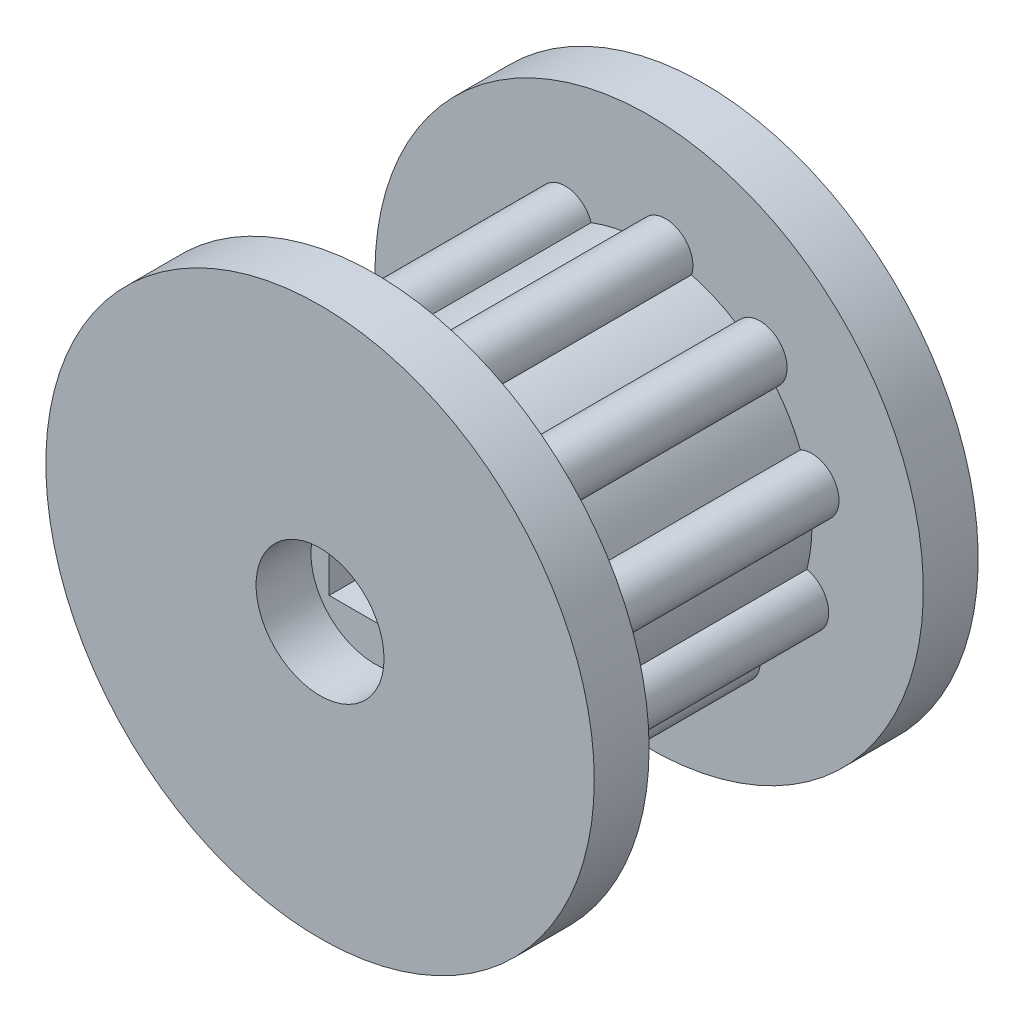
ISO-10303-21;
HEADER;
FILE_DESCRIPTION(('STEP AP214'),'2;1');
FILE_NAME('part.step','',(''),(''),'','','');
FILE_SCHEMA(('AUTOMOTIVE_DESIGN { 1 0 10303 214 1 1 1 1 }'));
ENDSEC;
DATA;
#1=APPLICATION_CONTEXT('core data for automotive mechanical design processes');
#2=APPLICATION_PROTOCOL_DEFINITION('international standard','automotive_design',2000,#1);
#3=PRODUCT_CONTEXT('',#1,'mechanical');
#4=PRODUCT('Part','Part','',(#3));
#5=PRODUCT_RELATED_PRODUCT_CATEGORY('part','',(#4));
#6=PRODUCT_DEFINITION_FORMATION('','',#4);
#7=PRODUCT_DEFINITION_CONTEXT('part definition',#1,'design');
#8=PRODUCT_DEFINITION('design','',#6,#7);
#9=PRODUCT_DEFINITION_SHAPE('','',#8);
#10=(LENGTH_UNIT() NAMED_UNIT(*) SI_UNIT(.MILLI.,.METRE.));
#11=(NAMED_UNIT(*) PLANE_ANGLE_UNIT() SI_UNIT($,.RADIAN.));
#12=(NAMED_UNIT(*) SI_UNIT($,.STERADIAN.) SOLID_ANGLE_UNIT());
#13=UNCERTAINTY_MEASURE_WITH_UNIT(LENGTH_MEASURE(1.E-05),#10,'distance_accuracy_value','');
#14=(GEOMETRIC_REPRESENTATION_CONTEXT(3) GLOBAL_UNCERTAINTY_ASSIGNED_CONTEXT((#13)) GLOBAL_UNIT_ASSIGNED_CONTEXT((#10,
#11,#12)) REPRESENTATION_CONTEXT('',''));
#15=CARTESIAN_POINT('',(0.,0.,0.));
#16=DIRECTION('',(0.,0.,1.));
#17=DIRECTION('',(1.,0.,0.));
#18=AXIS2_PLACEMENT_3D('',#15,#16,#17);
#19=CARTESIAN_POINT('',(0.45423492338537,4.53021201384048,20.));
#20=DIRECTION('',(0.,0.,1.));
#21=DIRECTION('',(1.,0.,0.));
#22=AXIS2_PLACEMENT_3D('',#19,#20,#21);
#23=PLANE('',#22);
#24=DIRECTION('',(-1.,0.,0.));
#25=VECTOR('',#24,1.);
#26=CARTESIAN_POINT('',(-2.5,1.5,20.));
#27=LINE('',#26,#25);
#28=CARTESIAN_POINT('',(2.5,1.5,20.));
#29=VERTEX_POINT('',#28);
#30=CARTESIAN_POINT('',(-2.5,1.5,20.));
#31=VERTEX_POINT('',#30);
#32=EDGE_CURVE('E758',#29,#31,#27,.T.);
#33=ORIENTED_EDGE('',*,*,#32,.F.);
#34=DIRECTION('',(0.,1.,0.));
#35=VECTOR('',#34,1.);
#36=CARTESIAN_POINT('',(2.5,-1.5,20.));
#37=LINE('',#36,#35);
#38=CARTESIAN_POINT('',(2.5,-1.5,20.));
#39=VERTEX_POINT('',#38);
#40=EDGE_CURVE('E756',#39,#29,#37,.T.);
#41=ORIENTED_EDGE('',*,*,#40,.F.);
#42=DIRECTION('',(1.,0.,0.));
#43=VECTOR('',#42,1.);
#44=CARTESIAN_POINT('',(-2.5,-1.5,20.));
#45=LINE('',#44,#43);
#46=CARTESIAN_POINT('',(-2.5,-1.5,20.));
#47=VERTEX_POINT('',#46);
#48=EDGE_CURVE('E763',#47,#39,#45,.T.);
#49=ORIENTED_EDGE('',*,*,#48,.F.);
#50=DIRECTION('',(0.,-1.,0.));
#51=VECTOR('',#50,1.);
#52=CARTESIAN_POINT('',(-2.5,-1.5,20.));
#53=LINE('',#52,#51);
#54=EDGE_CURVE('E761',#31,#47,#53,.T.);
#55=ORIENTED_EDGE('',*,*,#54,.F.);
#56=EDGE_LOOP('',(#33,#41,#49,#55));
#57=FACE_BOUND('',#56,.T.);
#58=CARTESIAN_POINT('',(0.,0.,20.));
#59=DIRECTION('',(0.,0.,1.));
#60=DIRECTION('',(1.,0.,0.));
#61=AXIS2_PLACEMENT_3D('',#58,#59,#60);
#62=CIRCLE('',#61,3.5);
#63=CARTESIAN_POINT('',(3.5,0.,20.));
#64=VERTEX_POINT('',#63);
#65=EDGE_CURVE('E734',#64,#64,#62,.T.);
#66=ORIENTED_EDGE('',*,*,#65,.T.);
#67=EDGE_LOOP('',(#66));
#68=FACE_BOUND('',#67,.T.);
#69=ADVANCED_FACE('F34',(#57,#68),#23,.T.);
#70=CARTESIAN_POINT('',(0.45423492338537,4.53021201384048,5.));
#71=DIRECTION('',(0.,0.,1.));
#72=DIRECTION('',(1.,0.,0.));
#73=AXIS2_PLACEMENT_3D('',#70,#71,#72);
#74=PLANE('',#73);
#75=DIRECTION('',(0.,1.,0.));
#76=VECTOR('',#75,1.);
#77=CARTESIAN_POINT('',(2.5,-1.5,5.));
#78=LINE('',#77,#76);
#79=CARTESIAN_POINT('',(2.5,-1.5,5.));
#80=VERTEX_POINT('',#79);
#81=CARTESIAN_POINT('',(2.5,1.5,5.));
#82=VERTEX_POINT('',#81);
#83=EDGE_CURVE('E57',#80,#82,#78,.T.);
#84=ORIENTED_EDGE('',*,*,#83,.T.);
#85=DIRECTION('',(-1.,0.,0.));
#86=VECTOR('',#85,1.);
#87=CARTESIAN_POINT('',(-2.5,1.5,5.));
#88=LINE('',#87,#86);
#89=CARTESIAN_POINT('',(-2.5,1.5,5.));
#90=VERTEX_POINT('',#89);
#91=EDGE_CURVE('E767',#82,#90,#88,.T.);
#92=ORIENTED_EDGE('',*,*,#91,.T.);
#93=DIRECTION('',(0.,-1.,0.));
#94=VECTOR('',#93,1.);
#95=CARTESIAN_POINT('',(-2.5,-1.5,5.));
#96=LINE('',#95,#94);
#97=CARTESIAN_POINT('',(-2.5,-1.5,5.));
#98=VERTEX_POINT('',#97);
#99=EDGE_CURVE('E770',#90,#98,#96,.T.);
#100=ORIENTED_EDGE('',*,*,#99,.T.);
#101=DIRECTION('',(1.,0.,0.));
#102=VECTOR('',#101,1.);
#103=CARTESIAN_POINT('',(-2.5,-1.5,5.));
#104=LINE('',#103,#102);
#105=EDGE_CURVE('E759',#98,#80,#104,.T.);
#106=ORIENTED_EDGE('',*,*,#105,.T.);
#107=EDGE_LOOP('',(#84,#92,#100,#106));
#108=FACE_BOUND('',#107,.T.);
#109=CARTESIAN_POINT('',(0.,0.,5.));
#110=DIRECTION('',(0.,0.,-1.));
#111=DIRECTION('',(-1.,0.,0.));
#112=AXIS2_PLACEMENT_3D('',#109,#110,#111);
#113=CIRCLE('',#112,3.5);
#114=CARTESIAN_POINT('',(-3.5,0.,5.));
#115=VERTEX_POINT('',#114);
#116=EDGE_CURVE('E742',#115,#115,#113,.T.);
#117=ORIENTED_EDGE('',*,*,#116,.T.);
#118=EDGE_LOOP('',(#117));
#119=FACE_BOUND('',#118,.T.);
#120=ADVANCED_FACE('F443',(#108,#119),#74,.F.);
#121=CARTESIAN_POINT('',(0.,0.,20.));
#122=DIRECTION('',(0.,0.,-1.));
#123=DIRECTION('',(-1.,0.,0.));
#124=AXIS2_PLACEMENT_3D('',#121,#122,#123);
#125=CYLINDRICAL_SURFACE('',#124,8.90704584484708);
#126=CARTESIAN_POINT('',(0.,0.,5.));
#127=DIRECTION('',(0.,0.,1.));
#128=DIRECTION('',(1.,0.,0.));
#129=AXIS2_PLACEMENT_3D('',#126,#127,#128);
#130=CIRCLE('',#129,8.90704584484708);
#131=CARTESIAN_POINT('',(4.76323695441032,7.52642274911179,5.));
#132=VERTEX_POINT('',#131);
#133=CARTESIAN_POINT('',(2.32379934039809,8.59857094567306,5.));
#134=VERTEX_POINT('',#133);
#135=EDGE_CURVE('E226',#132,#134,#130,.T.);
#136=ORIENTED_EDGE('',*,*,#135,.T.);
#137=DIRECTION('',(0.,0.,-1.));
#138=VECTOR('',#137,1.);
#139=CARTESIAN_POINT('',(2.32379934039809,8.59857094567306,20.));
#140=LINE('',#139,#138);
#141=CARTESIAN_POINT('',(2.32379934039809,8.59857094567306,20.));
#142=VERTEX_POINT('',#141);
#143=EDGE_CURVE('E11',#142,#134,#140,.T.);
#144=ORIENTED_EDGE('',*,*,#143,.F.);
#145=CARTESIAN_POINT('',(0.,0.,20.));
#146=DIRECTION('',(0.,0.,1.));
#147=DIRECTION('',(1.,0.,0.));
#148=AXIS2_PLACEMENT_3D('',#145,#146,#147);
#149=CIRCLE('',#148,8.90704584484708);
#150=CARTESIAN_POINT('',(4.76323695441032,7.52642274911179,20.));
#151=VERTEX_POINT('',#150);
#152=EDGE_CURVE('E198',#151,#142,#149,.T.);
#153=ORIENTED_EDGE('',*,*,#152,.F.);
#154=DIRECTION('',(0.,0.,-1.));
#155=VECTOR('',#154,1.);
#156=CARTESIAN_POINT('',(4.76323695441032,7.52642274911179,20.));
#157=LINE('',#156,#155);
#158=EDGE_CURVE('E201',#151,#132,#157,.T.);
#159=ORIENTED_EDGE('',*,*,#158,.T.);
#160=EDGE_LOOP('',(#136,#144,#153,#159));
#161=FACE_BOUND('',#160,.T.);
#162=ADVANCED_FACE('F36',(#161),#125,.T.);
#163=CARTESIAN_POINT('',(0.90846984677074,9.06042402768096,20.));
#164=DIRECTION('',(0.,0.,-1.));
#165=DIRECTION('',(-1.,0.,0.));
#166=AXIS2_PLACEMENT_3D('',#163,#164,#165);
#167=CYLINDRICAL_SURFACE('',#166,1.48877998538792);
#168=CARTESIAN_POINT('',(0.90846984677074,9.06042402768096,5.));
#169=DIRECTION('',(0.,0.,1.));
#170=DIRECTION('',(1.,0.,0.));
#171=AXIS2_PLACEMENT_3D('',#168,#169,#170);
#172=CIRCLE('',#171,1.48877998538792);
#173=CARTESIAN_POINT('',(-0.570380652259023,8.88876434571961,5.));
#174=VERTEX_POINT('',#173);
#175=EDGE_CURVE('E228',#134,#174,#172,.T.);
#176=ORIENTED_EDGE('',*,*,#175,.T.);
#177=DIRECTION('',(0.,0.,-1.));
#178=VECTOR('',#177,1.);
#179=CARTESIAN_POINT('',(-0.570380652259023,8.88876434571961,20.));
#180=LINE('',#179,#178);
#181=CARTESIAN_POINT('',(-0.570380652259023,8.88876434571961,20.));
#182=VERTEX_POINT('',#181);
#183=EDGE_CURVE('E42',#182,#174,#180,.T.);
#184=ORIENTED_EDGE('',*,*,#183,.F.);
#185=CARTESIAN_POINT('',(0.90846984677074,9.06042402768096,20.));
#186=DIRECTION('',(0.,0.,1.));
#187=DIRECTION('',(1.,0.,0.));
#188=AXIS2_PLACEMENT_3D('',#185,#186,#187);
#189=CIRCLE('',#188,1.48877998538792);
#190=EDGE_CURVE('E205',#142,#182,#189,.T.);
#191=ORIENTED_EDGE('',*,*,#190,.F.);
#192=ORIENTED_EDGE('',*,*,#143,.T.);
#193=EDGE_LOOP('',(#176,#184,#191,#192));
#194=FACE_BOUND('',#193,.T.);
#195=ADVANCED_FACE('F339',(#194),#167,.T.);
#196=CARTESIAN_POINT('',(0.,0.,20.));
#197=DIRECTION('',(0.,0.,-1.));
#198=DIRECTION('',(-1.,0.,0.));
#199=AXIS2_PLACEMENT_3D('',#196,#197,#198);
#200=CYLINDRICAL_SURFACE('',#199,8.90704584484708);
#201=CARTESIAN_POINT('',(0.,0.,5.));
#202=DIRECTION('',(0.,0.,1.));
#203=DIRECTION('',(1.,0.,0.));
#204=AXIS2_PLACEMENT_3D('',#201,#202,#203);
#205=CIRCLE('',#204,8.90704584484708);
#206=CARTESIAN_POINT('',(-3.17412003720251,8.32228500302874,5.));
#207=VERTEX_POINT('',#206);
#208=EDGE_CURVE('E232',#174,#207,#205,.T.);
#209=ORIENTED_EDGE('',*,*,#208,.T.);
#210=DIRECTION('',(0.,0.,-1.));
#211=VECTOR('',#210,1.);
#212=CARTESIAN_POINT('',(-3.17412003720251,8.32228500302874,20.));
#213=LINE('',#212,#211);
#214=CARTESIAN_POINT('',(-3.17412003720251,8.32228500302874,20.));
#215=VERTEX_POINT('',#214);
#216=EDGE_CURVE('E330',#215,#207,#213,.T.);
#217=ORIENTED_EDGE('',*,*,#216,.F.);
#218=CARTESIAN_POINT('',(0.,0.,20.));
#219=DIRECTION('',(0.,0.,1.));
#220=DIRECTION('',(1.,0.,0.));
#221=AXIS2_PLACEMENT_3D('',#218,#219,#220);
#222=CIRCLE('',#221,8.90704584484708);
#223=EDGE_CURVE('E337',#182,#215,#222,.T.);
#224=ORIENTED_EDGE('',*,*,#223,.F.);
#225=ORIENTED_EDGE('',*,*,#183,.T.);
#226=EDGE_LOOP('',(#209,#217,#224,#225));
#227=FACE_BOUND('',#226,.T.);
#228=ADVANCED_FACE('F335',(#227),#200,.T.);
#229=CARTESIAN_POINT('',(-4.59061607993777,7.86402218999784,20.));
#230=DIRECTION('',(0.,0.,-1.));
#231=DIRECTION('',(-1.,0.,0.));
#232=AXIS2_PLACEMENT_3D('',#229,#230,#231);
#233=CYLINDRICAL_SURFACE('',#232,1.48877998538792);
#234=CARTESIAN_POINT('',(-4.59061607993777,7.86402218999784,5.));
#235=DIRECTION('',(0.,0.,1.));
#236=DIRECTION('',(1.,0.,0.));
#237=AXIS2_PLACEMENT_3D('',#234,#235,#236);
#238=CIRCLE('',#237,1.48877998538792);
#239=CARTESIAN_POINT('',(-5.68613223693659,6.85590007703424,5.));
#240=VERTEX_POINT('',#239);
#241=EDGE_CURVE('E235',#207,#240,#238,.T.);
#242=ORIENTED_EDGE('',*,*,#241,.T.);
#243=DIRECTION('',(0.,0.,-1.));
#244=VECTOR('',#243,1.);
#245=CARTESIAN_POINT('',(-5.68613223693659,6.85590007703424,20.));
#246=LINE('',#245,#244);
#247=CARTESIAN_POINT('',(-5.68613223693659,6.85590007703424,20.));
#248=VERTEX_POINT('',#247);
#249=EDGE_CURVE('E327',#248,#240,#246,.T.);
#250=ORIENTED_EDGE('',*,*,#249,.F.);
#251=CARTESIAN_POINT('',(-4.59061607993777,7.86402218999784,20.));
#252=DIRECTION('',(0.,0.,1.));
#253=DIRECTION('',(1.,0.,0.));
#254=AXIS2_PLACEMENT_3D('',#251,#252,#253);
#255=CIRCLE('',#254,1.48877998538792);
#256=EDGE_CURVE('E355',#215,#248,#255,.T.);
#257=ORIENTED_EDGE('',*,*,#256,.F.);
#258=ORIENTED_EDGE('',*,*,#216,.T.);
#259=EDGE_LOOP('',(#242,#250,#257,#258));
#260=FACE_BOUND('',#259,.T.);
#261=ADVANCED_FACE('F344',(#260),#233,.T.);
#262=CARTESIAN_POINT('',(0.,0.,20.));
#263=DIRECTION('',(0.,0.,-1.));
#264=DIRECTION('',(-1.,0.,0.));
#265=AXIS2_PLACEMENT_3D('',#262,#263,#264);
#266=CYLINDRICAL_SURFACE('',#265,8.90704584484708);
#267=CARTESIAN_POINT('',(0.,0.,5.));
#268=DIRECTION('',(0.,0.,1.));
#269=DIRECTION('',(1.,0.,0.));
#270=AXIS2_PLACEMENT_3D('',#267,#268,#269);
#271=CIRCLE('',#270,8.90704584484708);
#272=CARTESIAN_POINT('',(-7.45963344424338,4.86716904984132,5.));
#273=VERTEX_POINT('',#272);
#274=EDGE_CURVE('E238',#240,#273,#271,.T.);
#275=ORIENTED_EDGE('',*,*,#274,.T.);
#276=DIRECTION('',(0.,0.,-1.));
#277=VECTOR('',#276,1.);
#278=CARTESIAN_POINT('',(-7.45963344424338,4.86716904984132,20.));
#279=LINE('',#278,#277);
#280=CARTESIAN_POINT('',(-7.45963344424338,4.86716904984132,20.));
#281=VERTEX_POINT('',#280);
#282=EDGE_CURVE('E324',#281,#273,#279,.T.);
#283=ORIENTED_EDGE('',*,*,#282,.F.);
#284=CARTESIAN_POINT('',(0.,0.,20.));
#285=DIRECTION('',(0.,0.,1.));
#286=DIRECTION('',(1.,0.,0.));
#287=AXIS2_PLACEMENT_3D('',#284,#285,#286);
#288=CIRCLE('',#287,8.90704584484708);
#289=EDGE_CURVE('E350',#248,#281,#288,.T.);
#290=ORIENTED_EDGE('',*,*,#289,.F.);
#291=ORIENTED_EDGE('',*,*,#249,.T.);
#292=EDGE_LOOP('',(#275,#283,#290,#291));
#293=FACE_BOUND('',#292,.T.);
#294=ADVANCED_FACE('F348',(#293),#266,.T.);
#295=CARTESIAN_POINT('',(-8.3362426921673,3.66383116240243,20.));
#296=DIRECTION('',(0.,0.,-1.));
#297=DIRECTION('',(-1.,0.,0.));
#298=AXIS2_PLACEMENT_3D('',#295,#296,#297);
#299=CYLINDRICAL_SURFACE('',#298,1.48877998538792);
#300=CARTESIAN_POINT('',(-8.3362426921673,3.66383116240243,5.));
#301=DIRECTION('',(0.,0.,1.));
#302=DIRECTION('',(1.,0.,0.));
#303=AXIS2_PLACEMENT_3D('',#300,#301,#302);
#304=CIRCLE('',#303,1.48877998538792);
#305=CARTESIAN_POINT('',(-8.62997456916931,2.20431499965378,5.));
#306=VERTEX_POINT('',#305);
#307=EDGE_CURVE('E241',#273,#306,#304,.T.);
#308=ORIENTED_EDGE('',*,*,#307,.T.);
#309=DIRECTION('',(0.,0.,-1.));
#310=VECTOR('',#309,1.);
#311=CARTESIAN_POINT('',(-8.62997456916931,2.20431499965378,20.));
#312=LINE('',#311,#310);
#313=CARTESIAN_POINT('',(-8.62997456916931,2.20431499965378,20.));
#314=VERTEX_POINT('',#313);
#315=EDGE_CURVE('E321',#314,#306,#312,.T.);
#316=ORIENTED_EDGE('',*,*,#315,.F.);
#317=CARTESIAN_POINT('',(-8.3362426921673,3.66383116240243,20.));
#318=DIRECTION('',(0.,0.,1.));
#319=DIRECTION('',(1.,0.,0.));
#320=AXIS2_PLACEMENT_3D('',#317,#318,#319);
#321=CIRCLE('',#320,1.48877998538792);
#322=EDGE_CURVE('E354',#281,#314,#321,.T.);
#323=ORIENTED_EDGE('',*,*,#322,.F.);
#324=ORIENTED_EDGE('',*,*,#282,.T.);
#325=EDGE_LOOP('',(#308,#316,#323,#324));
#326=FACE_BOUND('',#325,.T.);
#327=ADVANCED_FACE('F433',(#326),#299,.T.);
#328=CARTESIAN_POINT('',(0.,0.,20.));
#329=DIRECTION('',(0.,0.,-1.));
#330=DIRECTION('',(-1.,0.,0.));
#331=AXIS2_PLACEMENT_3D('',#328,#329,#330);
#332=CYLINDRICAL_SURFACE('',#331,8.90704584484708);
#333=CARTESIAN_POINT('',(0.,0.,5.));
#334=DIRECTION('',(0.,0.,1.));
#335=DIRECTION('',(1.,0.,0.));
#336=AXIS2_PLACEMENT_3D('',#333,#334,#335);
#337=CIRCLE('',#336,8.90704584484708);
#338=CARTESIAN_POINT('',(-8.89582041597473,-0.447040052942517,5.));
#339=VERTEX_POINT('',#338);
#340=EDGE_CURVE('E244',#306,#339,#337,.T.);
#341=ORIENTED_EDGE('',*,*,#340,.T.);
#342=DIRECTION('',(0.,0.,-1.));
#343=VECTOR('',#342,1.);
#344=CARTESIAN_POINT('',(-8.89582041597473,-0.447040052942517,20.));
#345=LINE('',#344,#343);
#346=CARTESIAN_POINT('',(-8.89582041597473,-0.447040052942517,20.));
#347=VERTEX_POINT('',#346);
#348=EDGE_CURVE('E318',#347,#339,#345,.T.);
#349=ORIENTED_EDGE('',*,*,#348,.F.);
#350=CARTESIAN_POINT('',(0.,0.,20.));
#351=DIRECTION('',(0.,0.,1.));
#352=DIRECTION('',(1.,0.,0.));
#353=AXIS2_PLACEMENT_3D('',#350,#351,#352);
#354=CIRCLE('',#353,8.90704584484708);
#355=EDGE_CURVE('E362',#314,#347,#354,.T.);
#356=ORIENTED_EDGE('',*,*,#355,.F.);
#357=ORIENTED_EDGE('',*,*,#315,.T.);
#358=EDGE_LOOP('',(#341,#349,#356,#357));
#359=FACE_BOUND('',#358,.T.);
#360=ADVANCED_FACE('F430',(#359),#332,.T.);
#361=CARTESIAN_POINT('',(-8.89770793321231,-1.93581884180617,20.));
#362=DIRECTION('',(0.,0.,-1.));
#363=DIRECTION('',(-1.,0.,0.));
#364=AXIS2_PLACEMENT_3D('',#361,#362,#363);
#365=CYLINDRICAL_SURFACE('',#364,1.48877998538792);
#366=CARTESIAN_POINT('',(-8.89770793321231,-1.93581884180617,5.));
#367=DIRECTION('',(0.,0.,1.));
#368=DIRECTION('',(1.,0.,0.));
#369=AXIS2_PLACEMENT_3D('',#366,#367,#368);
#370=CIRCLE('',#369,1.48877998538792);
#371=CARTESIAN_POINT('',(-8.27745993505703,-3.28924348532203,5.));
#372=VERTEX_POINT('',#371);
#373=EDGE_CURVE('E247',#339,#372,#370,.T.);
#374=ORIENTED_EDGE('',*,*,#373,.T.);
#375=DIRECTION('',(0.,0.,-1.));
#376=VECTOR('',#375,1.);
#377=CARTESIAN_POINT('',(-8.27745993505703,-3.28924348532203,20.));
#378=LINE('',#377,#376);
#379=CARTESIAN_POINT('',(-8.27745993505703,-3.28924348532203,20.));
#380=VERTEX_POINT('',#379);
#381=EDGE_CURVE('E315',#380,#372,#378,.T.);
#382=ORIENTED_EDGE('',*,*,#381,.F.);
#383=CARTESIAN_POINT('',(-8.89770793321231,-1.93581884180617,20.));
#384=DIRECTION('',(0.,0.,1.));
#385=DIRECTION('',(1.,0.,0.));
#386=AXIS2_PLACEMENT_3D('',#383,#384,#385);
#387=CIRCLE('',#386,1.48877998538792);
#388=EDGE_CURVE('E365',#347,#380,#387,.T.);
#389=ORIENTED_EDGE('',*,*,#388,.F.);
#390=ORIENTED_EDGE('',*,*,#348,.T.);
#391=EDGE_LOOP('',(#374,#382,#389,#390));
#392=FACE_BOUND('',#391,.T.);
#393=ADVANCED_FACE('F428',(#392),#365,.T.);
#394=CARTESIAN_POINT('',(0.,0.,20.));
#395=DIRECTION('',(0.,0.,-1.));
#396=DIRECTION('',(-1.,0.,0.));
#397=AXIS2_PLACEMENT_3D('',#394,#395,#396);
#398=CYLINDRICAL_SURFACE('',#397,8.90704584484708);
#399=CARTESIAN_POINT('',(0.,0.,5.));
#400=DIRECTION('',(0.,0.,1.));
#401=DIRECTION('',(1.,0.,0.));
#402=AXIS2_PLACEMENT_3D('',#399,#400,#401);
#403=CIRCLE('',#402,8.90704584484708);
#404=CARTESIAN_POINT('',(-6.93410634442936,-5.59049504841496,5.));
#405=VERTEX_POINT('',#404);
#406=EDGE_CURVE('E250',#372,#405,#403,.T.);
#407=ORIENTED_EDGE('',*,*,#406,.T.);
#408=DIRECTION('',(0.,0.,-1.));
#409=VECTOR('',#408,1.);
#410=CARTESIAN_POINT('',(-6.93410634442936,-5.59049504841496,20.));
#411=LINE('',#410,#409);
#412=CARTESIAN_POINT('',(-6.93410634442936,-5.59049504841496,20.));
#413=VERTEX_POINT('',#412);
#414=EDGE_CURVE('E312',#413,#405,#411,.T.);
#415=ORIENTED_EDGE('',*,*,#414,.F.);
#416=CARTESIAN_POINT('',(0.,0.,20.));
#417=DIRECTION('',(0.,0.,1.));
#418=DIRECTION('',(1.,0.,0.));
#419=AXIS2_PLACEMENT_3D('',#416,#417,#418);
#420=CIRCLE('',#419,8.90704584484708);
#421=EDGE_CURVE('E368',#380,#413,#420,.T.);
#422=ORIENTED_EDGE('',*,*,#421,.F.);
#423=ORIENTED_EDGE('',*,*,#381,.T.);
#424=EDGE_LOOP('',(#407,#415,#422,#423));
#425=FACE_BOUND('',#424,.T.);
#426=ADVANCED_FACE('F424',(#425),#398,.T.);
#427=CARTESIAN_POINT('',(-6.06055116449524,-6.79605184612377,20.));
#428=DIRECTION('',(0.,0.,-1.));
#429=DIRECTION('',(-1.,0.,0.));
#430=AXIS2_PLACEMENT_3D('',#427,#428,#429);
#431=CYLINDRICAL_SURFACE('',#430,1.48877998538792);
#432=CARTESIAN_POINT('',(-6.06055116449524,-6.79605184612377,5.));
#433=DIRECTION('',(0.,0.,1.));
#434=DIRECTION('',(1.,0.,0.));
#435=AXIS2_PLACEMENT_3D('',#432,#433,#434);
#436=CIRCLE('',#435,1.48877998538792);
#437=CARTESIAN_POINT('',(-4.7632369460923,-7.52642275437601,5.));
#438=VERTEX_POINT('',#437);
#439=EDGE_CURVE('E253',#405,#438,#436,.T.);
#440=ORIENTED_EDGE('',*,*,#439,.T.);
#441=DIRECTION('',(0.,0.,-1.));
#442=VECTOR('',#441,1.);
#443=CARTESIAN_POINT('',(-4.7632369460923,-7.52642275437601,20.));
#444=LINE('',#443,#442);
#445=CARTESIAN_POINT('',(-4.7632369460923,-7.52642275437601,20.));
#446=VERTEX_POINT('',#445);
#447=EDGE_CURVE('E309',#446,#438,#444,.T.);
#448=ORIENTED_EDGE('',*,*,#447,.F.);
#449=CARTESIAN_POINT('',(-6.06055116449524,-6.79605184612377,20.));
#450=DIRECTION('',(0.,0.,1.));
#451=DIRECTION('',(1.,0.,0.));
#452=AXIS2_PLACEMENT_3D('',#449,#450,#451);
#453=CIRCLE('',#452,1.48877998538792);
#454=EDGE_CURVE('E371',#413,#446,#453,.T.);
#455=ORIENTED_EDGE('',*,*,#454,.F.);
#456=ORIENTED_EDGE('',*,*,#414,.T.);
#457=EDGE_LOOP('',(#440,#448,#455,#456));
#458=FACE_BOUND('',#457,.T.);
#459=ADVANCED_FACE('F422',(#458),#431,.T.);
#460=CARTESIAN_POINT('',(0.,0.,20.));
#461=DIRECTION('',(0.,0.,-1.));
#462=DIRECTION('',(-1.,0.,0.));
#463=AXIS2_PLACEMENT_3D('',#460,#461,#462);
#464=CYLINDRICAL_SURFACE('',#463,8.90704584484708);
#465=CARTESIAN_POINT('',(0.,0.,5.));
#466=DIRECTION('',(0.,0.,1.));
#467=DIRECTION('',(1.,0.,0.));
#468=AXIS2_PLACEMENT_3D('',#465,#466,#467);
#469=CIRCLE('',#468,8.90704584484708);
#470=CARTESIAN_POINT('',(-2.3237993318715,-8.59857094797741,5.));
#471=VERTEX_POINT('',#470);
#472=EDGE_CURVE('E256',#438,#471,#469,.T.);
#473=ORIENTED_EDGE('',*,*,#472,.T.);
#474=DIRECTION('',(0.,0.,-1.));
#475=VECTOR('',#474,1.);
#476=CARTESIAN_POINT('',(-2.3237993318715,-8.59857094797741,20.));
#477=LINE('',#476,#475);
#478=CARTESIAN_POINT('',(-2.3237993318715,-8.59857094797741,20.));
#479=VERTEX_POINT('',#478);
#480=EDGE_CURVE('E306',#479,#471,#477,.T.);
#481=ORIENTED_EDGE('',*,*,#480,.F.);
#482=CARTESIAN_POINT('',(0.,0.,20.));
#483=DIRECTION('',(0.,0.,1.));
#484=DIRECTION('',(1.,0.,0.));
#485=AXIS2_PLACEMENT_3D('',#482,#483,#484);
#486=CIRCLE('',#485,8.90704584484708);
#487=EDGE_CURVE('E374',#446,#479,#486,.T.);
#488=ORIENTED_EDGE('',*,*,#487,.F.);
#489=ORIENTED_EDGE('',*,*,#447,.T.);
#490=EDGE_LOOP('',(#473,#481,#488,#489));
#491=FACE_BOUND('',#490,.T.);
#492=ADVANCED_FACE('F418',(#491),#464,.T.);
#493=CARTESIAN_POINT('',(-0.908469840254201,-9.06042403614505,20.));
#494=DIRECTION('',(0.,0.,-1.));
#495=DIRECTION('',(-1.,0.,0.));
#496=AXIS2_PLACEMENT_3D('',#493,#494,#495);
#497=CYLINDRICAL_SURFACE('',#496,1.48877998538792);
#498=CARTESIAN_POINT('',(-0.908469840254201,-9.06042403614505,5.));
#499=DIRECTION('',(0.,0.,1.));
#500=DIRECTION('',(1.,0.,0.));
#501=AXIS2_PLACEMENT_3D('',#498,#499,#500);
#502=CIRCLE('',#501,1.48877998538792);
#503=CARTESIAN_POINT('',(0.570380657752163,-8.88876434536712,5.));
#504=VERTEX_POINT('',#503);
#505=EDGE_CURVE('E259',#471,#504,#502,.T.);
#506=ORIENTED_EDGE('',*,*,#505,.T.);
#507=DIRECTION('',(0.,0.,-1.));
#508=VECTOR('',#507,1.);
#509=CARTESIAN_POINT('',(0.570380657752163,-8.88876434536712,20.));
#510=LINE('',#509,#508);
#511=CARTESIAN_POINT('',(0.570380657752163,-8.88876434536712,20.));
#512=VERTEX_POINT('',#511);
#513=EDGE_CURVE('E303',#512,#504,#510,.T.);
#514=ORIENTED_EDGE('',*,*,#513,.F.);
#515=CARTESIAN_POINT('',(-0.908469840254201,-9.06042403614505,20.));
#516=DIRECTION('',(0.,0.,1.));
#517=DIRECTION('',(1.,0.,0.));
#518=AXIS2_PLACEMENT_3D('',#515,#516,#517);
#519=CIRCLE('',#518,1.48877998538792);
#520=EDGE_CURVE('E377',#479,#512,#519,.T.);
#521=ORIENTED_EDGE('',*,*,#520,.F.);
#522=ORIENTED_EDGE('',*,*,#480,.T.);
#523=EDGE_LOOP('',(#506,#514,#521,#522));
#524=FACE_BOUND('',#523,.T.);
#525=ADVANCED_FACE('F416',(#524),#497,.T.);
#526=CARTESIAN_POINT('',(0.,0.,20.));
#527=DIRECTION('',(0.,0.,-1.));
#528=DIRECTION('',(-1.,0.,0.));
#529=AXIS2_PLACEMENT_3D('',#526,#527,#528);
#530=CYLINDRICAL_SURFACE('',#529,8.90704584484708);
#531=CARTESIAN_POINT('',(0.,0.,5.));
#532=DIRECTION('',(0.,0.,1.));
#533=DIRECTION('',(1.,0.,0.));
#534=AXIS2_PLACEMENT_3D('',#531,#532,#533);
#535=CIRCLE('',#534,8.90704584484708);
#536=CARTESIAN_POINT('',(3.17412004056576,-8.322285001746,5.));
#537=VERTEX_POINT('',#536);
#538=EDGE_CURVE('E262',#504,#537,#535,.T.);
#539=ORIENTED_EDGE('',*,*,#538,.T.);
#540=DIRECTION('',(0.,0.,-1.));
#541=VECTOR('',#540,1.);
#542=CARTESIAN_POINT('',(3.17412004056576,-8.322285001746,20.));
#543=LINE('',#542,#541);
#544=CARTESIAN_POINT('',(3.17412004056576,-8.322285001746,20.));
#545=VERTEX_POINT('',#544);
#546=EDGE_CURVE('E300',#545,#537,#543,.T.);
#547=ORIENTED_EDGE('',*,*,#546,.F.);
#548=CARTESIAN_POINT('',(0.,0.,20.));
#549=DIRECTION('',(0.,0.,1.));
#550=DIRECTION('',(1.,0.,0.));
#551=AXIS2_PLACEMENT_3D('',#548,#549,#550);
#552=CIRCLE('',#551,8.90704584484708);
#553=EDGE_CURVE('E380',#512,#545,#552,.T.);
#554=ORIENTED_EDGE('',*,*,#553,.F.);
#555=ORIENTED_EDGE('',*,*,#513,.T.);
#556=EDGE_LOOP('',(#539,#547,#554,#555));
#557=FACE_BOUND('',#556,.T.);
#558=ADVANCED_FACE('F412',(#557),#530,.T.);
#559=CARTESIAN_POINT('',(4.5906160864543,-7.86402219846193,20.));
#560=DIRECTION('',(0.,0.,-1.));
#561=DIRECTION('',(-1.,0.,0.));
#562=AXIS2_PLACEMENT_3D('',#559,#560,#561);
#563=CYLINDRICAL_SURFACE('',#562,1.48877998538792);
#564=CARTESIAN_POINT('',(4.5906160864543,-7.86402219846193,5.));
#565=DIRECTION('',(0.,0.,1.));
#566=DIRECTION('',(1.,0.,0.));
#567=AXIS2_PLACEMENT_3D('',#564,#565,#566);
#568=CIRCLE('',#567,1.48877998538792);
#569=CARTESIAN_POINT('',(5.68613223621499,-6.85590007763272,5.));
#570=VERTEX_POINT('',#569);
#571=EDGE_CURVE('E265',#537,#570,#568,.T.);
#572=ORIENTED_EDGE('',*,*,#571,.T.);
#573=DIRECTION('',(0.,0.,-1.));
#574=VECTOR('',#573,1.);
#575=CARTESIAN_POINT('',(5.68613223621499,-6.85590007763272,20.));
#576=LINE('',#575,#574);
#577=CARTESIAN_POINT('',(5.68613223621499,-6.85590007763272,20.));
#578=VERTEX_POINT('',#577);
#579=EDGE_CURVE('E297',#578,#570,#576,.T.);
#580=ORIENTED_EDGE('',*,*,#579,.F.);
#581=CARTESIAN_POINT('',(4.5906160864543,-7.86402219846193,20.));
#582=DIRECTION('',(0.,0.,1.));
#583=DIRECTION('',(1.,0.,0.));
#584=AXIS2_PLACEMENT_3D('',#581,#582,#583);
#585=CIRCLE('',#584,1.48877998538792);
#586=EDGE_CURVE('E383',#545,#578,#585,.T.);
#587=ORIENTED_EDGE('',*,*,#586,.F.);
#588=ORIENTED_EDGE('',*,*,#546,.T.);
#589=EDGE_LOOP('',(#572,#580,#587,#588));
#590=FACE_BOUND('',#589,.T.);
#591=ADVANCED_FACE('F410',(#590),#563,.T.);
#592=CARTESIAN_POINT('',(0.,0.,20.));
#593=DIRECTION('',(0.,0.,-1.));
#594=DIRECTION('',(-1.,0.,0.));
#595=AXIS2_PLACEMENT_3D('',#592,#593,#594);
#596=CYLINDRICAL_SURFACE('',#595,8.90704584484708);
#597=CARTESIAN_POINT('',(0.,0.,5.));
#598=DIRECTION('',(0.,0.,1.));
#599=DIRECTION('',(1.,0.,0.));
#600=AXIS2_PLACEMENT_3D('',#597,#598,#599);
#601=CIRCLE('',#600,8.90704584484708);
#602=CARTESIAN_POINT('',(7.45963344259954,-4.86716905236074,5.));
#603=VERTEX_POINT('',#602);
#604=EDGE_CURVE('E268',#570,#603,#601,.T.);
#605=ORIENTED_EDGE('',*,*,#604,.T.);
#606=DIRECTION('',(0.,0.,-1.));
#607=VECTOR('',#606,1.);
#608=CARTESIAN_POINT('',(7.45963344259954,-4.86716905236074,20.));
#609=LINE('',#608,#607);
#610=CARTESIAN_POINT('',(7.45963344259954,-4.86716905236074,20.));
#611=VERTEX_POINT('',#610);
#612=EDGE_CURVE('E294',#611,#603,#609,.T.);
#613=ORIENTED_EDGE('',*,*,#612,.F.);
#614=CARTESIAN_POINT('',(0.,0.,20.));
#615=DIRECTION('',(0.,0.,1.));
#616=DIRECTION('',(1.,0.,0.));
#617=AXIS2_PLACEMENT_3D('',#614,#615,#616);
#618=CIRCLE('',#617,8.90704584484708);
#619=EDGE_CURVE('E386',#578,#611,#618,.T.);
#620=ORIENTED_EDGE('',*,*,#619,.F.);
#621=ORIENTED_EDGE('',*,*,#579,.T.);
#622=EDGE_LOOP('',(#605,#613,#620,#621));
#623=FACE_BOUND('',#622,.T.);
#624=ADVANCED_FACE('F406',(#623),#596,.T.);
#625=CARTESIAN_POINT('',(8.33624269868384,-3.66383117086652,20.));
#626=DIRECTION('',(0.,0.,-1.));
#627=DIRECTION('',(-1.,0.,0.));
#628=AXIS2_PLACEMENT_3D('',#625,#626,#627);
#629=CYLINDRICAL_SURFACE('',#628,1.48877998538792);
#630=CARTESIAN_POINT('',(8.33624269868384,-3.66383117086652,5.));
#631=DIRECTION('',(0.,0.,1.));
#632=DIRECTION('',(1.,0.,0.));
#633=AXIS2_PLACEMENT_3D('',#630,#631,#632);
#634=CIRCLE('',#633,1.48877998538792);
#635=CARTESIAN_POINT('',(8.62997456743167,-2.2043150064567,5.));
#636=VERTEX_POINT('',#635);
#637=EDGE_CURVE('E271',#603,#636,#634,.T.);
#638=ORIENTED_EDGE('',*,*,#637,.T.);
#639=DIRECTION('',(0.,0.,-1.));
#640=VECTOR('',#639,1.);
#641=CARTESIAN_POINT('',(8.62997456743167,-2.2043150064567,20.));
#642=LINE('',#641,#640);
#643=CARTESIAN_POINT('',(8.62997456743167,-2.2043150064567,20.));
#644=VERTEX_POINT('',#643);
#645=EDGE_CURVE('E291',#644,#636,#642,.T.);
#646=ORIENTED_EDGE('',*,*,#645,.F.);
#647=CARTESIAN_POINT('',(8.33624269868384,-3.66383117086652,20.));
#648=DIRECTION('',(0.,0.,1.));
#649=DIRECTION('',(1.,0.,0.));
#650=AXIS2_PLACEMENT_3D('',#647,#648,#649);
#651=CIRCLE('',#650,1.48877998538792);
#652=EDGE_CURVE('E389',#611,#644,#651,.T.);
#653=ORIENTED_EDGE('',*,*,#652,.F.);
#654=ORIENTED_EDGE('',*,*,#612,.T.);
#655=EDGE_LOOP('',(#638,#646,#653,#654));
#656=FACE_BOUND('',#655,.T.);
#657=ADVANCED_FACE('F404',(#656),#629,.T.);
#658=CARTESIAN_POINT('',(0.,0.,20.));
#659=DIRECTION('',(0.,0.,-1.));
#660=DIRECTION('',(-1.,0.,0.));
#661=AXIS2_PLACEMENT_3D('',#658,#659,#660);
#662=CYLINDRICAL_SURFACE('',#661,8.90704584484708);
#663=CARTESIAN_POINT('',(0.,0.,5.));
#664=DIRECTION('',(0.,0.,1.));
#665=DIRECTION('',(1.,0.,0.));
#666=AXIS2_PLACEMENT_3D('',#663,#664,#665);
#667=CIRCLE('',#666,8.90704584484708);
#668=CARTESIAN_POINT('',(8.89582041639968,0.447040044486145,5.));
#669=VERTEX_POINT('',#668);
#670=EDGE_CURVE('E274',#636,#669,#667,.T.);
#671=ORIENTED_EDGE('',*,*,#670,.T.);
#672=DIRECTION('',(0.,0.,-1.));
#673=VECTOR('',#672,1.);
#674=CARTESIAN_POINT('',(8.89582041639968,0.447040044486145,20.));
#675=LINE('',#674,#673);
#676=CARTESIAN_POINT('',(8.89582041639968,0.447040044486145,20.));
#677=VERTEX_POINT('',#676);
#678=EDGE_CURVE('E288',#677,#669,#675,.T.);
#679=ORIENTED_EDGE('',*,*,#678,.F.);
#680=CARTESIAN_POINT('',(0.,0.,20.));
#681=DIRECTION('',(0.,0.,1.));
#682=DIRECTION('',(1.,0.,0.));
#683=AXIS2_PLACEMENT_3D('',#680,#681,#682);
#684=CIRCLE('',#683,8.90704584484708);
#685=EDGE_CURVE('E392',#644,#677,#684,.T.);
#686=ORIENTED_EDGE('',*,*,#685,.F.);
#687=ORIENTED_EDGE('',*,*,#645,.T.);
#688=EDGE_LOOP('',(#671,#679,#686,#687));
#689=FACE_BOUND('',#688,.T.);
#690=ADVANCED_FACE('F401',(#689),#662,.T.);
#691=CARTESIAN_POINT('',(8.89770793972884,1.93581883334208,20.));
#692=DIRECTION('',(0.,0.,-1.));
#693=DIRECTION('',(-1.,0.,0.));
#694=AXIS2_PLACEMENT_3D('',#691,#692,#693);
#695=CYLINDRICAL_SURFACE('',#694,1.48877998538792);
#696=CARTESIAN_POINT('',(8.89770793972884,1.93581883334208,5.));
#697=DIRECTION('',(0.,0.,1.));
#698=DIRECTION('',(1.,0.,0.));
#699=AXIS2_PLACEMENT_3D('',#696,#697,#698);
#700=CIRCLE('',#699,1.48877998538792);
#701=CARTESIAN_POINT('',(8.27745993890618,3.28924347563552,5.));
#702=VERTEX_POINT('',#701);
#703=EDGE_CURVE('E277',#669,#702,#700,.T.);
#704=ORIENTED_EDGE('',*,*,#703,.T.);
#705=DIRECTION('',(0.,0.,-1.));
#706=VECTOR('',#705,1.);
#707=CARTESIAN_POINT('',(8.27745993890618,3.28924347563552,20.));
#708=LINE('',#707,#706);
#709=CARTESIAN_POINT('',(8.27745993890618,3.28924347563552,20.));
#710=VERTEX_POINT('',#709);
#711=EDGE_CURVE('E285',#710,#702,#708,.T.);
#712=ORIENTED_EDGE('',*,*,#711,.F.);
#713=CARTESIAN_POINT('',(8.89770793972884,1.93581883334208,20.));
#714=DIRECTION('',(0.,0.,1.));
#715=DIRECTION('',(1.,0.,0.));
#716=AXIS2_PLACEMENT_3D('',#713,#714,#715);
#717=CIRCLE('',#716,1.48877998538792);
#718=EDGE_CURVE('E222',#677,#710,#717,.T.);
#719=ORIENTED_EDGE('',*,*,#718,.F.);
#720=ORIENTED_EDGE('',*,*,#678,.T.);
#721=EDGE_LOOP('',(#704,#712,#719,#720));
#722=FACE_BOUND('',#721,.T.);
#723=ADVANCED_FACE('F397',(#722),#695,.T.);
#724=CARTESIAN_POINT('',(0.,0.,20.));
#725=DIRECTION('',(0.,0.,-1.));
#726=DIRECTION('',(-1.,0.,0.));
#727=AXIS2_PLACEMENT_3D('',#724,#725,#726);
#728=CYLINDRICAL_SURFACE('',#727,8.90704584484708);
#729=CARTESIAN_POINT('',(0.,0.,5.));
#730=DIRECTION('',(0.,0.,1.));
#731=DIRECTION('',(1.,0.,0.));
#732=AXIS2_PLACEMENT_3D('',#729,#730,#731);
#733=CIRCLE('',#732,8.90704584484708);
#734=CARTESIAN_POINT('',(6.93410635113999,5.5904950400915,5.));
#735=VERTEX_POINT('',#734);
#736=EDGE_CURVE('E280',#702,#735,#733,.T.);
#737=ORIENTED_EDGE('',*,*,#736,.T.);
#738=DIRECTION('',(0.,0.,-1.));
#739=VECTOR('',#738,1.);
#740=CARTESIAN_POINT('',(6.93410635113999,5.5904950400915,20.));
#741=LINE('',#740,#739);
#742=CARTESIAN_POINT('',(6.93410635113999,5.5904950400915,20.));
#743=VERTEX_POINT('',#742);
#744=EDGE_CURVE('E215',#743,#735,#741,.T.);
#745=ORIENTED_EDGE('',*,*,#744,.F.);
#746=CARTESIAN_POINT('',(0.,0.,20.));
#747=DIRECTION('',(0.,0.,1.));
#748=DIRECTION('',(1.,0.,0.));
#749=AXIS2_PLACEMENT_3D('',#746,#747,#748);
#750=CIRCLE('',#749,8.90704584484708);
#751=EDGE_CURVE('E220',#710,#743,#750,.T.);
#752=ORIENTED_EDGE('',*,*,#751,.F.);
#753=ORIENTED_EDGE('',*,*,#711,.T.);
#754=EDGE_LOOP('',(#737,#745,#752,#753));
#755=FACE_BOUND('',#754,.T.);
#756=ADVANCED_FACE('F399',(#755),#728,.T.);
#757=CARTESIAN_POINT('',(6.06055117101178,6.79605183765967,20.));
#758=DIRECTION('',(0.,0.,-1.));
#759=DIRECTION('',(-1.,0.,0.));
#760=AXIS2_PLACEMENT_3D('',#757,#758,#759);
#761=CYLINDRICAL_SURFACE('',#760,1.48877998538792);
#762=CARTESIAN_POINT('',(6.06055117101178,6.79605183765967,5.));
#763=DIRECTION('',(0.,0.,1.));
#764=DIRECTION('',(1.,0.,0.));
#765=AXIS2_PLACEMENT_3D('',#762,#763,#764);
#766=CIRCLE('',#765,1.48877998538792);
#767=EDGE_CURVE('E206',#735,#132,#766,.T.);
#768=ORIENTED_EDGE('',*,*,#767,.T.);
#769=ORIENTED_EDGE('',*,*,#158,.F.);
#770=CARTESIAN_POINT('',(6.06055117101178,6.79605183765967,20.));
#771=DIRECTION('',(0.,0.,1.));
#772=DIRECTION('',(1.,0.,0.));
#773=AXIS2_PLACEMENT_3D('',#770,#771,#772);
#774=CIRCLE('',#773,1.48877998538792);
#775=EDGE_CURVE('E213',#743,#151,#774,.T.);
#776=ORIENTED_EDGE('',*,*,#775,.F.);
#777=ORIENTED_EDGE('',*,*,#744,.T.);
#778=EDGE_LOOP('',(#768,#769,#776,#777));
#779=FACE_BOUND('',#778,.T.);
#780=ADVANCED_FACE('F211',(#779),#761,.T.);
#781=CARTESIAN_POINT('',(2.5,-1.5,20.));
#782=DIRECTION('',(-1.,0.,0.));
#783=DIRECTION('',(0.,0.,1.));
#784=AXIS2_PLACEMENT_3D('',#781,#782,#783);
#785=PLANE('',#784);
#786=ORIENTED_EDGE('',*,*,#83,.F.);
#787=DIRECTION('',(0.,0.,-1.));
#788=VECTOR('',#787,1.);
#789=CARTESIAN_POINT('',(2.5,-1.5,20.));
#790=LINE('',#789,#788);
#791=EDGE_CURVE('E765',#39,#80,#790,.T.);
#792=ORIENTED_EDGE('',*,*,#791,.F.);
#793=ORIENTED_EDGE('',*,*,#40,.T.);
#794=DIRECTION('',(0.,0.,-1.));
#795=VECTOR('',#794,1.);
#796=CARTESIAN_POINT('',(2.5,1.5,20.));
#797=LINE('',#796,#795);
#798=EDGE_CURVE('E229',#29,#82,#797,.T.);
#799=ORIENTED_EDGE('',*,*,#798,.T.);
#800=EDGE_LOOP('',(#786,#792,#793,#799));
#801=FACE_BOUND('',#800,.T.);
#802=ADVANCED_FACE('F454',(#801),#785,.T.);
#803=CARTESIAN_POINT('',(-2.5,1.5,20.));
#804=DIRECTION('',(0.,-1.,0.));
#805=DIRECTION('',(0.,0.,-1.));
#806=AXIS2_PLACEMENT_3D('',#803,#804,#805);
#807=PLANE('',#806);
#808=ORIENTED_EDGE('',*,*,#91,.F.);
#809=ORIENTED_EDGE('',*,*,#798,.F.);
#810=ORIENTED_EDGE('',*,*,#32,.T.);
#811=DIRECTION('',(0.,0.,-1.));
#812=VECTOR('',#811,1.);
#813=CARTESIAN_POINT('',(-2.5,1.5,20.));
#814=LINE('',#813,#812);
#815=EDGE_CURVE('E777',#31,#90,#814,.T.);
#816=ORIENTED_EDGE('',*,*,#815,.T.);
#817=EDGE_LOOP('',(#808,#809,#810,#816));
#818=FACE_BOUND('',#817,.T.);
#819=ADVANCED_FACE('F541',(#818),#807,.T.);
#820=CARTESIAN_POINT('',(-2.5,-1.5,20.));
#821=DIRECTION('',(1.,0.,0.));
#822=DIRECTION('',(0.,0.,-1.));
#823=AXIS2_PLACEMENT_3D('',#820,#821,#822);
#824=PLANE('',#823);
#825=ORIENTED_EDGE('',*,*,#99,.F.);
#826=ORIENTED_EDGE('',*,*,#815,.F.);
#827=ORIENTED_EDGE('',*,*,#54,.T.);
#828=DIRECTION('',(0.,0.,-1.));
#829=VECTOR('',#828,1.);
#830=CARTESIAN_POINT('',(-2.5,-1.5,20.));
#831=LINE('',#830,#829);
#832=EDGE_CURVE('E49',#47,#98,#831,.T.);
#833=ORIENTED_EDGE('',*,*,#832,.T.);
#834=EDGE_LOOP('',(#825,#826,#827,#833));
#835=FACE_BOUND('',#834,.T.);
#836=ADVANCED_FACE('F547',(#835),#824,.T.);
#837=CARTESIAN_POINT('',(-2.5,-1.5,20.));
#838=DIRECTION('',(0.,1.,0.));
#839=DIRECTION('',(0.,0.,1.));
#840=AXIS2_PLACEMENT_3D('',#837,#838,#839);
#841=PLANE('',#840);
#842=ORIENTED_EDGE('',*,*,#105,.F.);
#843=ORIENTED_EDGE('',*,*,#832,.F.);
#844=ORIENTED_EDGE('',*,*,#48,.T.);
#845=ORIENTED_EDGE('',*,*,#791,.T.);
#846=EDGE_LOOP('',(#842,#843,#844,#845));
#847=FACE_BOUND('',#846,.T.);
#848=ADVANCED_FACE('F554',(#847),#841,.T.);
#849=CARTESIAN_POINT('',(0.,0.,2.));
#850=DIRECTION('',(0.,0.,-1.));
#851=DIRECTION('',(-1.,0.,0.));
#852=AXIS2_PLACEMENT_3D('',#849,#850,#851);
#853=PLANE('',#852);
#854=CARTESIAN_POINT('',(0.,0.,2.));
#855=DIRECTION('',(0.,0.,-1.));
#856=DIRECTION('',(-1.,0.,0.));
#857=AXIS2_PLACEMENT_3D('',#854,#855,#856);
#858=CIRCLE('',#857,15.);
#859=CARTESIAN_POINT('',(-15.,0.,2.));
#860=VERTEX_POINT('',#859);
#861=EDGE_CURVE('E751',#860,#860,#858,.T.);
#862=ORIENTED_EDGE('',*,*,#861,.T.);
#863=EDGE_LOOP('',(#862));
#864=FACE_BOUND('',#863,.T.);
#865=CARTESIAN_POINT('',(0.,0.,2.));
#866=DIRECTION('',(0.,0.,-1.));
#867=DIRECTION('',(-1.,0.,0.));
#868=AXIS2_PLACEMENT_3D('',#865,#866,#867);
#869=CIRCLE('',#868,3.5);
#870=CARTESIAN_POINT('',(-3.5,0.,2.));
#871=VERTEX_POINT('',#870);
#872=EDGE_CURVE('E745',#871,#871,#869,.T.);
#873=ORIENTED_EDGE('',*,*,#872,.F.);
#874=EDGE_LOOP('',(#873));
#875=FACE_BOUND('',#874,.T.);
#876=ADVANCED_FACE('F562',(#864,#875),#853,.T.);
#877=CARTESIAN_POINT('',(0.,0.,5.));
#878=DIRECTION('',(0.,0.,-1.));
#879=DIRECTION('',(-1.,0.,0.));
#880=AXIS2_PLACEMENT_3D('',#877,#878,#879);
#881=PLANE('',#880);
#882=ORIENTED_EDGE('',*,*,#135,.F.);
#883=ORIENTED_EDGE('',*,*,#767,.F.);
#884=ORIENTED_EDGE('',*,*,#736,.F.);
#885=ORIENTED_EDGE('',*,*,#703,.F.);
#886=ORIENTED_EDGE('',*,*,#670,.F.);
#887=ORIENTED_EDGE('',*,*,#637,.F.);
#888=ORIENTED_EDGE('',*,*,#604,.F.);
#889=ORIENTED_EDGE('',*,*,#571,.F.);
#890=ORIENTED_EDGE('',*,*,#538,.F.);
#891=ORIENTED_EDGE('',*,*,#505,.F.);
#892=ORIENTED_EDGE('',*,*,#472,.F.);
#893=ORIENTED_EDGE('',*,*,#439,.F.);
#894=ORIENTED_EDGE('',*,*,#406,.F.);
#895=ORIENTED_EDGE('',*,*,#373,.F.);
#896=ORIENTED_EDGE('',*,*,#340,.F.);
#897=ORIENTED_EDGE('',*,*,#307,.F.);
#898=ORIENTED_EDGE('',*,*,#274,.F.);
#899=ORIENTED_EDGE('',*,*,#241,.F.);
#900=ORIENTED_EDGE('',*,*,#208,.F.);
#901=ORIENTED_EDGE('',*,*,#175,.F.);
#902=EDGE_LOOP('',(#882,#883,#884,#885,#886,#887,#888,#889,#890,#891,#892,#893,#894,#895,#896,
#897,#898,#899,#900,#901));
#903=FACE_BOUND('',#902,.T.);
#904=CARTESIAN_POINT('',(0.,0.,5.));
#905=DIRECTION('',(0.,0.,-1.));
#906=DIRECTION('',(-1.,0.,0.));
#907=AXIS2_PLACEMENT_3D('',#904,#905,#906);
#908=CIRCLE('',#907,15.);
#909=CARTESIAN_POINT('',(-15.,0.,5.));
#910=VERTEX_POINT('',#909);
#911=EDGE_CURVE('E748',#910,#910,#908,.T.);
#912=ORIENTED_EDGE('',*,*,#911,.F.);
#913=EDGE_LOOP('',(#912));
#914=FACE_BOUND('',#913,.T.);
#915=ADVANCED_FACE('F341',(#903,#914),#881,.F.);
#916=CARTESIAN_POINT('',(0.,0.,2.));
#917=DIRECTION('',(0.,0.,1.));
#918=DIRECTION('',(1.,0.,0.));
#919=AXIS2_PLACEMENT_3D('',#916,#917,#918);
#920=CYLINDRICAL_SURFACE('',#919,15.);
#921=ORIENTED_EDGE('',*,*,#861,.F.);
#922=EDGE_LOOP('',(#921));
#923=FACE_BOUND('',#922,.T.);
#924=ORIENTED_EDGE('',*,*,#911,.T.);
#925=EDGE_LOOP('',(#924));
#926=FACE_BOUND('',#925,.T.);
#927=ADVANCED_FACE('F577',(#923,#926),#920,.T.);
#928=CARTESIAN_POINT('',(0.,0.,2.));
#929=DIRECTION('',(0.,0.,1.));
#930=DIRECTION('',(1.,0.,0.));
#931=AXIS2_PLACEMENT_3D('',#928,#929,#930);
#932=CYLINDRICAL_SURFACE('',#931,3.5);
#933=ORIENTED_EDGE('',*,*,#872,.T.);
#934=EDGE_LOOP('',(#933));
#935=FACE_BOUND('',#934,.T.);
#936=ORIENTED_EDGE('',*,*,#116,.F.);
#937=EDGE_LOOP('',(#936));
#938=FACE_BOUND('',#937,.T.);
#939=ADVANCED_FACE('F584',(#935,#938),#932,.F.);
#940=CARTESIAN_POINT('',(0.,0.,20.));
#941=DIRECTION('',(0.,0.,1.));
#942=DIRECTION('',(1.,0.,0.));
#943=AXIS2_PLACEMENT_3D('',#940,#941,#942);
#944=PLANE('',#943);
#945=CARTESIAN_POINT('',(0.,0.,20.));
#946=DIRECTION('',(0.,0.,1.));
#947=DIRECTION('',(1.,0.,0.));
#948=AXIS2_PLACEMENT_3D('',#945,#946,#947);
#949=CIRCLE('',#948,15.);
#950=CARTESIAN_POINT('',(15.,0.,20.));
#951=VERTEX_POINT('',#950);
#952=EDGE_CURVE('E736',#951,#951,#949,.T.);
#953=ORIENTED_EDGE('',*,*,#952,.F.);
#954=EDGE_LOOP('',(#953));
#955=FACE_BOUND('',#954,.T.);
#956=ORIENTED_EDGE('',*,*,#775,.T.);
#957=ORIENTED_EDGE('',*,*,#152,.T.);
#958=ORIENTED_EDGE('',*,*,#190,.T.);
#959=ORIENTED_EDGE('',*,*,#223,.T.);
#960=ORIENTED_EDGE('',*,*,#256,.T.);
#961=ORIENTED_EDGE('',*,*,#289,.T.);
#962=ORIENTED_EDGE('',*,*,#322,.T.);
#963=ORIENTED_EDGE('',*,*,#355,.T.);
#964=ORIENTED_EDGE('',*,*,#388,.T.);
#965=ORIENTED_EDGE('',*,*,#421,.T.);
#966=ORIENTED_EDGE('',*,*,#454,.T.);
#967=ORIENTED_EDGE('',*,*,#487,.T.);
#968=ORIENTED_EDGE('',*,*,#520,.T.);
#969=ORIENTED_EDGE('',*,*,#553,.T.);
#970=ORIENTED_EDGE('',*,*,#586,.T.);
#971=ORIENTED_EDGE('',*,*,#619,.T.);
#972=ORIENTED_EDGE('',*,*,#652,.T.);
#973=ORIENTED_EDGE('',*,*,#685,.T.);
#974=ORIENTED_EDGE('',*,*,#718,.T.);
#975=ORIENTED_EDGE('',*,*,#751,.T.);
#976=EDGE_LOOP('',(#956,#957,#958,#959,#960,#961,#962,#963,#964,#965,#966,#967,#968,#969,#970,
#971,#972,#973,#974,#975));
#977=FACE_BOUND('',#976,.T.);
#978=ADVANCED_FACE('F217',(#955,#977),#944,.F.);
#979=CARTESIAN_POINT('',(0.,0.,23.));
#980=DIRECTION('',(0.,0.,1.));
#981=DIRECTION('',(1.,0.,0.));
#982=AXIS2_PLACEMENT_3D('',#979,#980,#981);
#983=PLANE('',#982);
#984=CARTESIAN_POINT('',(0.,0.,23.));
#985=DIRECTION('',(0.,0.,1.));
#986=DIRECTION('',(1.,0.,0.));
#987=AXIS2_PLACEMENT_3D('',#984,#985,#986);
#988=CIRCLE('',#987,15.);
#989=CARTESIAN_POINT('',(15.,0.,23.));
#990=VERTEX_POINT('',#989);
#991=EDGE_CURVE('E739',#990,#990,#988,.T.);
#992=ORIENTED_EDGE('',*,*,#991,.T.);
#993=EDGE_LOOP('',(#992));
#994=FACE_BOUND('',#993,.T.);
#995=CARTESIAN_POINT('',(0.,0.,23.));
#996=DIRECTION('',(0.,0.,1.));
#997=DIRECTION('',(1.,0.,0.));
#998=AXIS2_PLACEMENT_3D('',#995,#996,#997);
#999=CIRCLE('',#998,3.5);
#1000=CARTESIAN_POINT('',(3.5,0.,23.));
#1001=VERTEX_POINT('',#1000);
#1002=EDGE_CURVE('E731',#1001,#1001,#999,.T.);
#1003=ORIENTED_EDGE('',*,*,#1002,.F.);
#1004=EDGE_LOOP('',(#1003));
#1005=FACE_BOUND('',#1004,.T.);
#1006=ADVANCED_FACE('F598',(#994,#1005),#983,.T.);
#1007=CARTESIAN_POINT('',(0.,0.,23.));
#1008=DIRECTION('',(0.,0.,-1.));
#1009=DIRECTION('',(-1.,0.,0.));
#1010=AXIS2_PLACEMENT_3D('',#1007,#1008,#1009);
#1011=CYLINDRICAL_SURFACE('',#1010,15.);
#1012=ORIENTED_EDGE('',*,*,#991,.F.);
#1013=EDGE_LOOP('',(#1012));
#1014=FACE_BOUND('',#1013,.T.);
#1015=ORIENTED_EDGE('',*,*,#952,.T.);
#1016=EDGE_LOOP('',(#1015));
#1017=FACE_BOUND('',#1016,.T.);
#1018=ADVANCED_FACE('F606',(#1014,#1017),#1011,.T.);
#1019=CARTESIAN_POINT('',(0.,0.,23.));
#1020=DIRECTION('',(0.,0.,-1.));
#1021=DIRECTION('',(-1.,0.,0.));
#1022=AXIS2_PLACEMENT_3D('',#1019,#1020,#1021);
#1023=CYLINDRICAL_SURFACE('',#1022,3.5);
#1024=ORIENTED_EDGE('',*,*,#1002,.T.);
#1025=EDGE_LOOP('',(#1024));
#1026=FACE_BOUND('',#1025,.T.);
#1027=ORIENTED_EDGE('',*,*,#65,.F.);
#1028=EDGE_LOOP('',(#1027));
#1029=FACE_BOUND('',#1028,.T.);
#1030=ADVANCED_FACE('F614',(#1026,#1029),#1023,.F.);
#1031=CLOSED_SHELL('',(#69,#120,#162,#195,#228,#261,#294,#327,#360,#393,#426,#459,#492,#525,
#558,#591,#624,#657,#690,#723,#756,#780,#802,#819,#836,#848,#876,#915,#927,#939,#978,#1006,
#1018,#1030));
#1032=MANIFOLD_SOLID_BREP('B2',#1031);
#1033=ADVANCED_BREP_SHAPE_REPRESENTATION('',(#18,#1032),#14);
#1034=SHAPE_DEFINITION_REPRESENTATION(#9,#1033);
ENDSEC;
END-ISO-10303-21;
